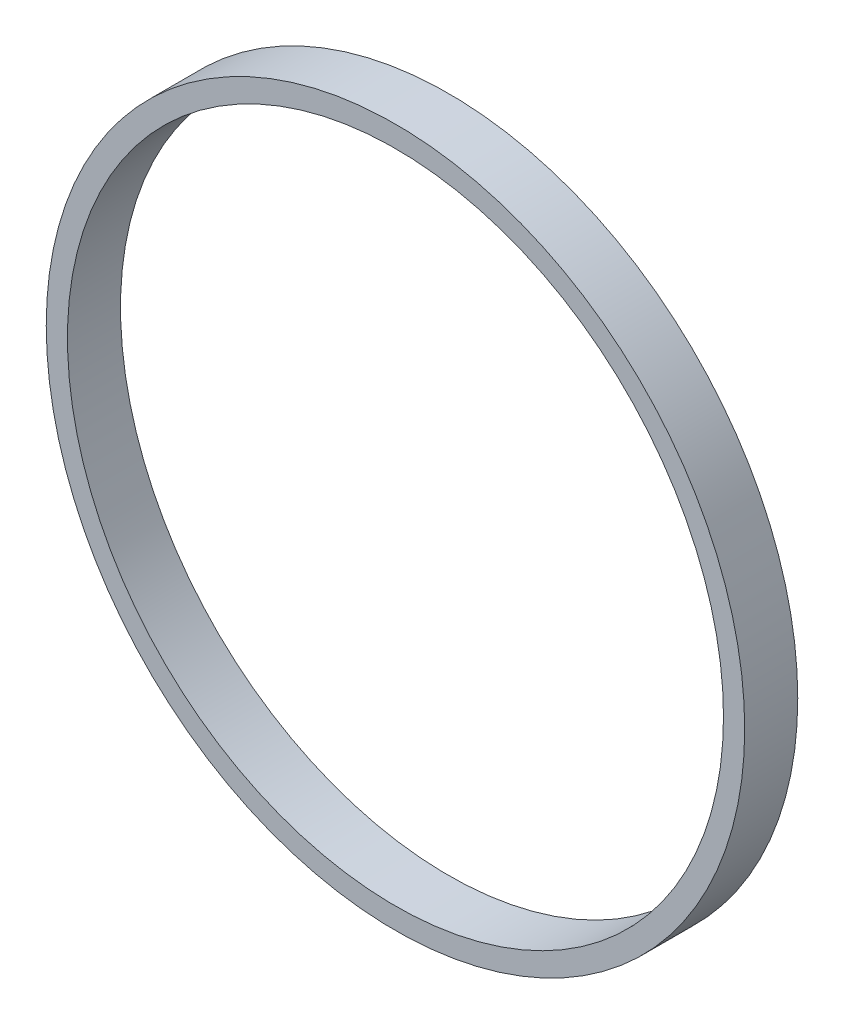
ISO-10303-21;
HEADER;
FILE_DESCRIPTION(('STEP AP214'),'2;1');
FILE_NAME('part.step','',(''),(''),'','','');
FILE_SCHEMA(('AUTOMOTIVE_DESIGN { 1 0 10303 214 1 1 1 1 }'));
ENDSEC;
DATA;
#1=APPLICATION_CONTEXT('core data for automotive mechanical design processes');
#2=APPLICATION_PROTOCOL_DEFINITION('international standard','automotive_design',2000,#1);
#3=PRODUCT_CONTEXT('',#1,'mechanical');
#4=PRODUCT('Part','Part','',(#3));
#5=PRODUCT_RELATED_PRODUCT_CATEGORY('part','',(#4));
#6=PRODUCT_DEFINITION_FORMATION('','',#4);
#7=PRODUCT_DEFINITION_CONTEXT('part definition',#1,'design');
#8=PRODUCT_DEFINITION('design','',#6,#7);
#9=PRODUCT_DEFINITION_SHAPE('','',#8);
#10=(LENGTH_UNIT() NAMED_UNIT(*) SI_UNIT(.MILLI.,.METRE.));
#11=(NAMED_UNIT(*) PLANE_ANGLE_UNIT() SI_UNIT($,.RADIAN.));
#12=(NAMED_UNIT(*) SI_UNIT($,.STERADIAN.) SOLID_ANGLE_UNIT());
#13=UNCERTAINTY_MEASURE_WITH_UNIT(LENGTH_MEASURE(1.E-05),#10,'distance_accuracy_value','');
#14=(GEOMETRIC_REPRESENTATION_CONTEXT(3) GLOBAL_UNCERTAINTY_ASSIGNED_CONTEXT((#13)) GLOBAL_UNIT_ASSIGNED_CONTEXT((#10,
#11,#12)) REPRESENTATION_CONTEXT('',''));
#15=CARTESIAN_POINT('',(0.,0.,0.));
#16=DIRECTION('',(0.,0.,1.));
#17=DIRECTION('',(1.,0.,0.));
#18=AXIS2_PLACEMENT_3D('',#15,#16,#17);
#19=CARTESIAN_POINT('',(0.,0.,6.35));
#20=DIRECTION('',(0.,0.,1.));
#21=DIRECTION('',(1.,0.,0.));
#22=AXIS2_PLACEMENT_3D('',#19,#20,#21);
#23=PLANE('',#22);
#24=CARTESIAN_POINT('',(0.,0.,6.35));
#25=DIRECTION('',(0.,0.,1.));
#26=DIRECTION('',(1.,0.,0.));
#27=AXIS2_PLACEMENT_3D('',#24,#25,#26);
#28=CIRCLE('',#27,41.7957);
#29=CARTESIAN_POINT('',(41.7957,0.,6.35));
#30=VERTEX_POINT('',#29);
#31=EDGE_CURVE('E10',#30,#30,#28,.T.);
#32=ORIENTED_EDGE('',*,*,#31,.T.);
#33=EDGE_LOOP('',(#32));
#34=FACE_BOUND('',#33,.T.);
#35=CARTESIAN_POINT('',(0.,0.,6.35));
#36=DIRECTION('',(0.,0.,1.));
#37=DIRECTION('',(1.,0.,0.));
#38=AXIS2_PLACEMENT_3D('',#35,#36,#37);
#39=CIRCLE('',#38,39.2557);
#40=CARTESIAN_POINT('',(39.2557,0.,6.35));
#41=VERTEX_POINT('',#40);
#42=EDGE_CURVE('E48',#41,#41,#39,.T.);
#43=ORIENTED_EDGE('',*,*,#42,.F.);
#44=EDGE_LOOP('',(#43));
#45=FACE_BOUND('',#44,.T.);
#46=ADVANCED_FACE('F37',(#34,#45),#23,.T.);
#47=CARTESIAN_POINT('',(0.,0.,0.));
#48=DIRECTION('',(0.,0.,1.));
#49=DIRECTION('',(1.,0.,0.));
#50=AXIS2_PLACEMENT_3D('',#47,#48,#49);
#51=PLANE('',#50);
#52=CARTESIAN_POINT('',(0.,0.,0.));
#53=DIRECTION('',(0.,0.,1.));
#54=DIRECTION('',(1.,0.,0.));
#55=AXIS2_PLACEMENT_3D('',#52,#53,#54);
#56=CIRCLE('',#55,41.7957);
#57=CARTESIAN_POINT('',(41.7957,0.,0.));
#58=VERTEX_POINT('',#57);
#59=EDGE_CURVE('E41',#58,#58,#56,.T.);
#60=ORIENTED_EDGE('',*,*,#59,.F.);
#61=EDGE_LOOP('',(#60));
#62=FACE_BOUND('',#61,.T.);
#63=CARTESIAN_POINT('',(0.,0.,0.));
#64=DIRECTION('',(0.,0.,1.));
#65=DIRECTION('',(1.,0.,0.));
#66=AXIS2_PLACEMENT_3D('',#63,#64,#65);
#67=CIRCLE('',#66,39.2557);
#68=CARTESIAN_POINT('',(39.2557,0.,0.));
#69=VERTEX_POINT('',#68);
#70=EDGE_CURVE('E50',#69,#69,#67,.T.);
#71=ORIENTED_EDGE('',*,*,#70,.T.);
#72=EDGE_LOOP('',(#71));
#73=FACE_BOUND('',#72,.T.);
#74=ADVANCED_FACE('F60',(#62,#73),#51,.F.);
#75=CARTESIAN_POINT('',(0.,0.,6.35));
#76=DIRECTION('',(0.,0.,-1.));
#77=DIRECTION('',(-1.,0.,0.));
#78=AXIS2_PLACEMENT_3D('',#75,#76,#77);
#79=CYLINDRICAL_SURFACE('',#78,41.7957);
#80=ORIENTED_EDGE('',*,*,#31,.F.);
#81=EDGE_LOOP('',(#80));
#82=FACE_BOUND('',#81,.T.);
#83=ORIENTED_EDGE('',*,*,#59,.T.);
#84=EDGE_LOOP('',(#83));
#85=FACE_BOUND('',#84,.T.);
#86=ADVANCED_FACE('F39',(#82,#85),#79,.T.);
#87=CARTESIAN_POINT('',(0.,0.,6.35));
#88=DIRECTION('',(0.,0.,-1.));
#89=DIRECTION('',(-1.,0.,0.));
#90=AXIS2_PLACEMENT_3D('',#87,#88,#89);
#91=CYLINDRICAL_SURFACE('',#90,39.2557);
#92=ORIENTED_EDGE('',*,*,#42,.T.);
#93=EDGE_LOOP('',(#92));
#94=FACE_BOUND('',#93,.T.);
#95=ORIENTED_EDGE('',*,*,#70,.F.);
#96=EDGE_LOOP('',(#95));
#97=FACE_BOUND('',#96,.T.);
#98=ADVANCED_FACE('F56',(#94,#97),#91,.F.);
#99=CLOSED_SHELL('',(#46,#74,#86,#98));
#100=MANIFOLD_SOLID_BREP('B2',#99);
#101=ADVANCED_BREP_SHAPE_REPRESENTATION('',(#18,#100),#14);
#102=SHAPE_DEFINITION_REPRESENTATION(#9,#101);
ENDSEC;
END-ISO-10303-21;
